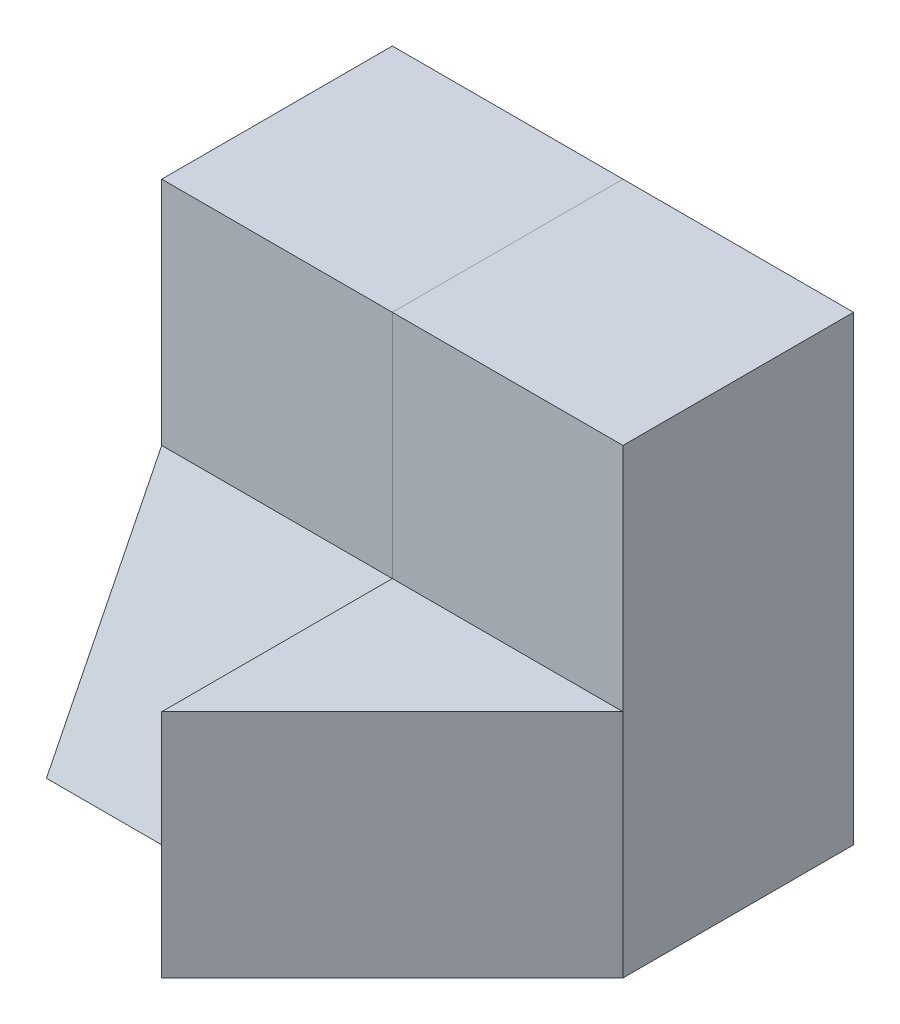
ISO-10303-21;
HEADER;
FILE_DESCRIPTION(('STEP AP214'),'2;1');
FILE_NAME('part.step','',(''),(''),'','','');
FILE_SCHEMA(('AUTOMOTIVE_DESIGN { 1 0 10303 214 1 1 1 1 }'));
ENDSEC;
DATA;
#1=APPLICATION_CONTEXT('core data for automotive mechanical design processes');
#2=APPLICATION_PROTOCOL_DEFINITION('international standard','automotive_design',2000,#1);
#3=PRODUCT_CONTEXT('',#1,'mechanical');
#4=PRODUCT('Part','Part','',(#3));
#5=PRODUCT_RELATED_PRODUCT_CATEGORY('part','',(#4));
#6=PRODUCT_DEFINITION_FORMATION('','',#4);
#7=PRODUCT_DEFINITION_CONTEXT('part definition',#1,'design');
#8=PRODUCT_DEFINITION('design','',#6,#7);
#9=PRODUCT_DEFINITION_SHAPE('','',#8);
#10=(LENGTH_UNIT() NAMED_UNIT(*) SI_UNIT(.MILLI.,.METRE.));
#11=(NAMED_UNIT(*) PLANE_ANGLE_UNIT() SI_UNIT($,.RADIAN.));
#12=(NAMED_UNIT(*) SI_UNIT($,.STERADIAN.) SOLID_ANGLE_UNIT());
#13=UNCERTAINTY_MEASURE_WITH_UNIT(LENGTH_MEASURE(1.E-05),#10,'distance_accuracy_value','');
#14=(GEOMETRIC_REPRESENTATION_CONTEXT(3) GLOBAL_UNCERTAINTY_ASSIGNED_CONTEXT((#13)) GLOBAL_UNIT_ASSIGNED_CONTEXT((#10,
#11,#12)) REPRESENTATION_CONTEXT('',''));
#15=CARTESIAN_POINT('',(0.,0.,0.));
#16=DIRECTION('',(0.,0.,1.));
#17=DIRECTION('',(1.,0.,0.));
#18=AXIS2_PLACEMENT_3D('',#15,#16,#17);
#19=CARTESIAN_POINT('',(0.,40.,40.));
#20=DIRECTION('',(0.,-1.,0.));
#21=DIRECTION('',(0.,0.,-1.));
#22=AXIS2_PLACEMENT_3D('',#19,#20,#21);
#23=PLANE('',#22);
#24=DIRECTION('',(0.,0.,-1.));
#25=VECTOR('',#24,1.);
#26=CARTESIAN_POINT('',(0.,40.,40.));
#27=LINE('',#26,#25);
#28=CARTESIAN_POINT('',(0.,40.,20.001));
#29=VERTEX_POINT('',#28);
#30=CARTESIAN_POINT('',(0.,40.,0.));
#31=VERTEX_POINT('',#30);
#32=EDGE_CURVE('E227',#29,#31,#27,.T.);
#33=ORIENTED_EDGE('',*,*,#32,.F.);
#34=DIRECTION('',(-1.,0.,0.));
#35=VECTOR('',#34,1.);
#36=CARTESIAN_POINT('',(20.0001,40.,20.001));
#37=LINE('',#36,#35);
#38=CARTESIAN_POINT('',(20.,40.,20.001));
#39=VERTEX_POINT('',#38);
#40=EDGE_CURVE('E295',#39,#29,#37,.T.);
#41=ORIENTED_EDGE('',*,*,#40,.F.);
#42=DIRECTION('',(0.,0.,-1.));
#43=VECTOR('',#42,1.);
#44=CARTESIAN_POINT('',(20.,40.,30.));
#45=LINE('',#44,#43);
#46=CARTESIAN_POINT('',(20.,40.,20.));
#47=VERTEX_POINT('',#46);
#48=EDGE_CURVE('E204',#39,#47,#45,.T.);
#49=ORIENTED_EDGE('',*,*,#48,.T.);
#50=DIRECTION('',(0.,0.,1.));
#51=VECTOR('',#50,1.);
#52=CARTESIAN_POINT('',(20.,40.,0.));
#53=LINE('',#52,#51);
#54=CARTESIAN_POINT('',(20.,40.,0.));
#55=VERTEX_POINT('',#54);
#56=EDGE_CURVE('E56',#55,#47,#53,.T.);
#57=ORIENTED_EDGE('',*,*,#56,.F.);
#58=DIRECTION('',(-1.,0.,0.));
#59=VECTOR('',#58,1.);
#60=CARTESIAN_POINT('',(0.,40.,0.));
#61=LINE('',#60,#59);
#62=EDGE_CURVE('E224',#55,#31,#61,.T.);
#63=ORIENTED_EDGE('',*,*,#62,.T.);
#64=EDGE_LOOP('',(#33,#41,#49,#57,#63));
#65=FACE_BOUND('',#64,.T.);
#66=ADVANCED_FACE('F33',(#65),#23,.F.);
#67=CARTESIAN_POINT('',(40.,40.,20.));
#68=DIRECTION('',(0.,0.,-1.));
#69=DIRECTION('',(-1.,0.,0.));
#70=AXIS2_PLACEMENT_3D('',#67,#68,#69);
#71=PLANE('',#70);
#72=DIRECTION('',(-1.,0.,0.));
#73=VECTOR('',#72,1.);
#74=CARTESIAN_POINT('',(40.,20.,20.));
#75=LINE('',#74,#73);
#76=CARTESIAN_POINT('',(40.,20.,20.));
#77=VERTEX_POINT('',#76);
#78=CARTESIAN_POINT('',(20.,20.,20.));
#79=VERTEX_POINT('',#78);
#80=EDGE_CURVE('E212',#77,#79,#75,.T.);
#81=ORIENTED_EDGE('',*,*,#80,.F.);
#82=DIRECTION('',(0.,-1.,0.));
#83=VECTOR('',#82,1.);
#84=CARTESIAN_POINT('',(40.,40.,20.));
#85=LINE('',#84,#83);
#86=CARTESIAN_POINT('',(40.,40.0001,20.));
#87=VERTEX_POINT('',#86);
#88=EDGE_CURVE('E209',#87,#77,#85,.T.);
#89=ORIENTED_EDGE('',*,*,#88,.F.);
#90=DIRECTION('',(1.,0.,0.));
#91=VECTOR('',#90,1.);
#92=CARTESIAN_POINT('',(40.,40.0001,20.));
#93=LINE('',#92,#91);
#94=CARTESIAN_POINT('',(20.,40.0001,20.));
#95=VERTEX_POINT('',#94);
#96=EDGE_CURVE('E283',#95,#87,#93,.T.);
#97=ORIENTED_EDGE('',*,*,#96,.F.);
#98=DIRECTION('',(0.,-1.,0.));
#99=VECTOR('',#98,1.);
#100=CARTESIAN_POINT('',(20.,40.0001,20.));
#101=LINE('',#100,#99);
#102=EDGE_CURVE('E182',#95,#47,#101,.T.);
#103=ORIENTED_EDGE('',*,*,#102,.T.);
#104=DIRECTION('',(0.,1.,0.));
#105=VECTOR('',#104,1.);
#106=CARTESIAN_POINT('',(20.,20.,20.));
#107=LINE('',#106,#105);
#108=CARTESIAN_POINT('',(20.,20.0001499995,20.));
#109=VERTEX_POINT('',#108);
#110=EDGE_CURVE('E200',#109,#47,#107,.T.);
#111=ORIENTED_EDGE('',*,*,#110,.F.);
#112=EDGE_CURVE('E201',#79,#109,#107,.T.);
#113=ORIENTED_EDGE('',*,*,#112,.F.);
#114=EDGE_LOOP('',(#81,#89,#97,#103,#111,#113));
#115=FACE_BOUND('',#114,.T.);
#116=ADVANCED_FACE('F281',(#115),#71,.F.);
#117=CARTESIAN_POINT('',(40.,20.,20.));
#118=DIRECTION('',(0.,-1.,0.));
#119=DIRECTION('',(0.,0.,-1.));
#120=AXIS2_PLACEMENT_3D('',#117,#118,#119);
#121=PLANE('',#120);
#122=DIRECTION('',(0.,0.,1.));
#123=VECTOR('',#122,1.);
#124=CARTESIAN_POINT('',(20.0001,20.,20.));
#125=LINE('',#124,#123);
#126=CARTESIAN_POINT('',(20.0001,20.,20.0014999300028));
#127=VERTEX_POINT('',#126);
#128=CARTESIAN_POINT('',(20.0001,20.0000000050002,39.9999000000002));
#129=VERTEX_POINT('',#128);
#130=EDGE_CURVE('E11',#127,#129,#125,.T.);
#131=ORIENTED_EDGE('',*,*,#130,.T.);
#132=DIRECTION('',(-0.707106781186548,0.,0.707106781186548));
#133=VECTOR('',#132,1.);
#134=CARTESIAN_POINT('',(20.,20.,40.));
#135=LINE('',#134,#133);
#136=EDGE_CURVE('E168',#77,#129,#135,.T.);
#137=ORIENTED_EDGE('',*,*,#136,.F.);
#138=ORIENTED_EDGE('',*,*,#80,.T.);
#139=DIRECTION('',(0.,0.,-1.));
#140=VECTOR('',#139,1.);
#141=CARTESIAN_POINT('',(20.,20.,30.));
#142=LINE('',#141,#140);
#143=CARTESIAN_POINT('',(20.,20.,20.0000749999375));
#144=VERTEX_POINT('',#143);
#145=EDGE_CURVE('E206',#144,#79,#142,.T.);
#146=ORIENTED_EDGE('',*,*,#145,.F.);
#147=CARTESIAN_POINT('',(20.,20.,20.0014999300028));
#148=VERTEX_POINT('',#147);
#149=EDGE_CURVE('E207',#148,#144,#142,.T.);
#150=ORIENTED_EDGE('',*,*,#149,.F.);
#151=DIRECTION('',(1.,0.,0.));
#152=VECTOR('',#151,1.);
#153=CARTESIAN_POINT('',(40.,20.,20.0014999300028));
#154=LINE('',#153,#152);
#155=EDGE_CURVE('E299',#148,#127,#154,.T.);
#156=ORIENTED_EDGE('',*,*,#155,.T.);
#157=EDGE_LOOP('',(#131,#137,#138,#146,#150,#156));
#158=FACE_BOUND('',#157,.T.);
#159=ADVANCED_FACE('F311',(#158),#121,.F.);
#160=CARTESIAN_POINT('',(0.,0.,40.));
#161=DIRECTION('',(1.,0.,0.));
#162=DIRECTION('',(0.,0.,-1.));
#163=AXIS2_PLACEMENT_3D('',#160,#161,#162);
#164=PLANE('',#163);
#165=DIRECTION('',(0.,0.894426743784979,-0.447214489928714));
#166=VECTOR('',#165,1.);
#167=CARTESIAN_POINT('',(0.,39.9999,10.0001));
#168=LINE('',#167,#166);
#169=CARTESIAN_POINT('',(0.,0.000199999500002934,30.));
#170=VERTEX_POINT('',#169);
#171=CARTESIAN_POINT('',(0.,39.9999,10.0001));
#172=VERTEX_POINT('',#171);
#173=EDGE_CURVE('E185',#170,#172,#168,.T.);
#174=ORIENTED_EDGE('',*,*,#173,.F.);
#175=DIRECTION('',(0.,-0.894452233262744,0.447163507468231));
#176=VECTOR('',#175,1.);
#177=CARTESIAN_POINT('',(0.,0.000199999500002934,30.));
#178=LINE('',#177,#176);
#179=CARTESIAN_POINT('',(0.,20.001,20.001));
#180=VERTEX_POINT('',#179);
#181=EDGE_CURVE('E165',#180,#170,#178,.T.);
#182=ORIENTED_EDGE('',*,*,#181,.F.);
#183=DIRECTION('',(0.,-1.,0.));
#184=VECTOR('',#183,1.);
#185=CARTESIAN_POINT('',(0.,40.,20.001));
#186=LINE('',#185,#184);
#187=EDGE_CURVE('E259',#29,#180,#186,.T.);
#188=ORIENTED_EDGE('',*,*,#187,.F.);
#189=ORIENTED_EDGE('',*,*,#32,.T.);
#190=DIRECTION('',(0.,-1.,0.));
#191=VECTOR('',#190,1.);
#192=CARTESIAN_POINT('',(0.,0.,0.));
#193=LINE('',#192,#191);
#194=CARTESIAN_POINT('',(0.,0.,0.));
#195=VERTEX_POINT('',#194);
#196=EDGE_CURVE('E216',#31,#195,#193,.T.);
#197=ORIENTED_EDGE('',*,*,#196,.T.);
#198=DIRECTION('',(0.,0.,-1.));
#199=VECTOR('',#198,1.);
#200=CARTESIAN_POINT('',(0.,0.,40.));
#201=LINE('',#200,#199);
#202=CARTESIAN_POINT('',(0.,0.,0.0001));
#203=VERTEX_POINT('',#202);
#204=EDGE_CURVE('E244',#203,#195,#201,.T.);
#205=ORIENTED_EDGE('',*,*,#204,.F.);
#206=DIRECTION('',(0.,-0.970142357476814,-0.242536195709693));
#207=VECTOR('',#206,1.);
#208=CARTESIAN_POINT('',(0.,39.9999,10.0001));
#209=LINE('',#208,#207);
#210=EDGE_CURVE('E180',#172,#203,#209,.T.);
#211=ORIENTED_EDGE('',*,*,#210,.F.);
#212=EDGE_LOOP('',(#174,#182,#188,#189,#197,#205,#211));
#213=FACE_BOUND('',#212,.T.);
#214=ADVANCED_FACE('F35',(#213),#164,.F.);
#215=CARTESIAN_POINT('',(0.,0.,40.));
#216=DIRECTION('',(0.,1.,0.));
#217=DIRECTION('',(0.,0.,1.));
#218=AXIS2_PLACEMENT_3D('',#215,#216,#217);
#219=PLANE('',#218);
#220=DIRECTION('',(0.,0.,-1.));
#221=VECTOR('',#220,1.);
#222=CARTESIAN_POINT('',(20.,0.,40.));
#223=LINE('',#222,#221);
#224=CARTESIAN_POINT('',(20.,0.,40.));
#225=VERTEX_POINT('',#224);
#226=CARTESIAN_POINT('',(20.,0.,0.0001));
#227=VERTEX_POINT('',#226);
#228=EDGE_CURVE('E159',#225,#227,#223,.T.);
#229=ORIENTED_EDGE('',*,*,#228,.T.);
#230=DIRECTION('',(-1.,0.,0.));
#231=VECTOR('',#230,1.);
#232=CARTESIAN_POINT('',(20.,0.,0.0001));
#233=LINE('',#232,#231);
#234=EDGE_CURVE('E169',#227,#203,#233,.T.);
#235=ORIENTED_EDGE('',*,*,#234,.T.);
#236=ORIENTED_EDGE('',*,*,#204,.T.);
#237=DIRECTION('',(1.,0.,0.));
#238=VECTOR('',#237,1.);
#239=CARTESIAN_POINT('',(0.,0.,0.));
#240=LINE('',#239,#238);
#241=CARTESIAN_POINT('',(40.,0.,0.));
#242=VERTEX_POINT('',#241);
#243=EDGE_CURVE('E219',#195,#242,#240,.T.);
#244=ORIENTED_EDGE('',*,*,#243,.T.);
#245=DIRECTION('',(0.,0.,-1.));
#246=VECTOR('',#245,1.);
#247=CARTESIAN_POINT('',(40.,0.,40.));
#248=LINE('',#247,#246);
#249=CARTESIAN_POINT('',(40.,0.,20.));
#250=VERTEX_POINT('',#249);
#251=EDGE_CURVE('E247',#250,#242,#248,.T.);
#252=ORIENTED_EDGE('',*,*,#251,.F.);
#253=DIRECTION('',(-0.707106781186548,0.,0.707106781186548));
#254=VECTOR('',#253,1.);
#255=CARTESIAN_POINT('',(10.,0.,50.));
#256=LINE('',#255,#254);
#257=CARTESIAN_POINT('',(20.0001,1.99999489396855E-09,39.9999));
#258=VERTEX_POINT('',#257);
#259=EDGE_CURVE('E197',#250,#258,#256,.T.);
#260=ORIENTED_EDGE('',*,*,#259,.T.);
#261=DIRECTION('',(-0.707106781115837,-1.41421002671852E-05,0.707106781115837));
#262=VECTOR('',#261,1.);
#263=CARTESIAN_POINT('',(19.999930000175,-1.39999383613754E-09,40.000069999825));
#264=LINE('',#263,#262);
#265=EDGE_CURVE('E267',#258,#225,#264,.T.);
#266=ORIENTED_EDGE('',*,*,#265,.T.);
#267=EDGE_LOOP('',(#229,#235,#236,#244,#252,#260,#266));
#268=FACE_BOUND('',#267,.T.);
#269=ADVANCED_FACE('F266',(#268),#219,.F.);
#270=CARTESIAN_POINT('',(40.,0.,40.));
#271=DIRECTION('',(-1.,0.,0.));
#272=DIRECTION('',(0.,0.,1.));
#273=AXIS2_PLACEMENT_3D('',#270,#271,#272);
#274=PLANE('',#273);
#275=ORIENTED_EDGE('',*,*,#88,.T.);
#276=DIRECTION('',(0.,1.,0.));
#277=VECTOR('',#276,1.);
#278=CARTESIAN_POINT('',(40.,-7.00000000000001,20.));
#279=LINE('',#278,#277);
#280=EDGE_CURVE('E195',#250,#77,#279,.T.);
#281=ORIENTED_EDGE('',*,*,#280,.F.);
#282=ORIENTED_EDGE('',*,*,#251,.T.);
#283=DIRECTION('',(0.,1.,0.));
#284=VECTOR('',#283,1.);
#285=CARTESIAN_POINT('',(40.,0.,0.));
#286=LINE('',#285,#284);
#287=CARTESIAN_POINT('',(40.,40.0001,0.));
#288=VERTEX_POINT('',#287);
#289=EDGE_CURVE('E222',#242,#288,#286,.T.);
#290=ORIENTED_EDGE('',*,*,#289,.T.);
#291=DIRECTION('',(0.,0.,-1.));
#292=VECTOR('',#291,1.);
#293=CARTESIAN_POINT('',(40.,40.0001,0.));
#294=LINE('',#293,#292);
#295=EDGE_CURVE('E234',#87,#288,#294,.T.);
#296=ORIENTED_EDGE('',*,*,#295,.F.);
#297=EDGE_LOOP('',(#275,#281,#282,#290,#296));
#298=FACE_BOUND('',#297,.T.);
#299=ADVANCED_FACE('F274',(#298),#274,.F.);
#300=CARTESIAN_POINT('',(0.,0.,0.));
#301=DIRECTION('',(0.,0.,-1.));
#302=DIRECTION('',(-1.,0.,0.));
#303=AXIS2_PLACEMENT_3D('',#300,#301,#302);
#304=PLANE('',#303);
#305=ORIENTED_EDGE('',*,*,#196,.F.);
#306=ORIENTED_EDGE('',*,*,#62,.F.);
#307=DIRECTION('',(0.,-1.,0.));
#308=VECTOR('',#307,1.);
#309=CARTESIAN_POINT('',(20.,40.0001,0.));
#310=LINE('',#309,#308);
#311=CARTESIAN_POINT('',(20.,40.0001,0.));
#312=VERTEX_POINT('',#311);
#313=EDGE_CURVE('E187',#312,#55,#310,.T.);
#314=ORIENTED_EDGE('',*,*,#313,.F.);
#315=DIRECTION('',(-1.,0.,0.));
#316=VECTOR('',#315,1.);
#317=CARTESIAN_POINT('',(40.,40.0001,0.));
#318=LINE('',#317,#316);
#319=EDGE_CURVE('E290',#288,#312,#318,.T.);
#320=ORIENTED_EDGE('',*,*,#319,.F.);
#321=ORIENTED_EDGE('',*,*,#289,.F.);
#322=ORIENTED_EDGE('',*,*,#243,.F.);
#323=EDGE_LOOP('',(#305,#306,#314,#320,#321,#322));
#324=FACE_BOUND('',#323,.T.);
#325=ADVANCED_FACE('F263',(#324),#304,.T.);
#326=CARTESIAN_POINT('',(20.,0.,40.));
#327=DIRECTION('',(1.,0.,0.));
#328=DIRECTION('',(0.,0.,-1.));
#329=AXIS2_PLACEMENT_3D('',#326,#327,#328);
#330=PLANE('',#329);
#331=ORIENTED_EDGE('',*,*,#228,.F.);
#332=DIRECTION('',(0.,-1.99999499962934E-05,0.999999999800001));
#333=VECTOR('',#332,1.);
#334=CARTESIAN_POINT('',(20.,0.000199999500002934,30.));
#335=LINE('',#334,#333);
#336=CARTESIAN_POINT('',(20.,0.000199999500002934,30.));
#337=VERTEX_POINT('',#336);
#338=EDGE_CURVE('E142',#337,#225,#335,.T.);
#339=ORIENTED_EDGE('',*,*,#338,.F.);
#340=DIRECTION('',(0.,0.894426743784979,-0.447214489928714));
#341=VECTOR('',#340,1.);
#342=CARTESIAN_POINT('',(20.,39.9999,10.0001));
#343=LINE('',#342,#341);
#344=EDGE_CURVE('E156',#337,#144,#343,.T.);
#345=ORIENTED_EDGE('',*,*,#344,.T.);
#346=ORIENTED_EDGE('',*,*,#145,.T.);
#347=ORIENTED_EDGE('',*,*,#112,.T.);
#348=CARTESIAN_POINT('',(20.,39.9999,10.0001));
#349=VERTEX_POINT('',#348);
#350=EDGE_CURVE('E176',#109,#349,#343,.T.);
#351=ORIENTED_EDGE('',*,*,#350,.T.);
#352=DIRECTION('',(0.,-0.970142357476814,-0.242536195709693));
#353=VECTOR('',#352,1.);
#354=CARTESIAN_POINT('',(20.,39.9999,10.0001));
#355=LINE('',#354,#353);
#356=EDGE_CURVE('E175',#349,#227,#355,.T.);
#357=ORIENTED_EDGE('',*,*,#356,.T.);
#358=EDGE_LOOP('',(#331,#339,#345,#346,#347,#351,#357));
#359=FACE_BOUND('',#358,.T.);
#360=ADVANCED_FACE('F154',(#359),#330,.F.);
#361=CARTESIAN_POINT('',(20.,20.,30.));
#362=DIRECTION('',(-1.,0.,0.));
#363=DIRECTION('',(0.,0.,1.));
#364=AXIS2_PLACEMENT_3D('',#361,#362,#363);
#365=PLANE('',#364);
#366=DIRECTION('',(0.,-1.,0.));
#367=VECTOR('',#366,1.);
#368=CARTESIAN_POINT('',(20.,20.,20.001));
#369=LINE('',#368,#367);
#370=CARTESIAN_POINT('',(20.,20.001,20.001));
#371=VERTEX_POINT('',#370);
#372=EDGE_CURVE('E41',#39,#371,#369,.T.);
#373=ORIENTED_EDGE('',*,*,#372,.T.);
#374=DIRECTION('',(0.,-0.894452233262744,0.447163507468231));
#375=VECTOR('',#374,1.);
#376=CARTESIAN_POINT('',(20.,16.0009359427147,22.0007520353084));
#377=LINE('',#376,#375);
#378=EDGE_CURVE('E48',#371,#148,#377,.T.);
#379=ORIENTED_EDGE('',*,*,#378,.T.);
#380=ORIENTED_EDGE('',*,*,#149,.T.);
#381=DIRECTION('',(0.,0.894426743784979,-0.447214489928714));
#382=VECTOR('',#381,1.);
#383=CARTESIAN_POINT('',(20.,16.000024000016,22.000067999912));
#384=LINE('',#383,#382);
#385=EDGE_CURVE('E174',#144,#109,#384,.T.);
#386=ORIENTED_EDGE('',*,*,#385,.T.);
#387=ORIENTED_EDGE('',*,*,#110,.T.);
#388=ORIENTED_EDGE('',*,*,#48,.F.);
#389=EDGE_LOOP('',(#373,#379,#380,#386,#387,#388));
#390=FACE_BOUND('',#389,.T.);
#391=ADVANCED_FACE('F312',(#390),#365,.F.);
#392=CARTESIAN_POINT('',(20.,-7.00000000000001,40.));
#393=DIRECTION('',(-0.707106781186547,0.,-0.707106781186547));
#394=DIRECTION('',(-0.707106781186548,0.,0.707106781186548));
#395=AXIS2_PLACEMENT_3D('',#392,#393,#394);
#396=PLANE('',#395);
#397=ORIENTED_EDGE('',*,*,#136,.T.);
#398=DIRECTION('',(0.,-1.,0.));
#399=VECTOR('',#398,1.);
#400=CARTESIAN_POINT('',(20.0001,-7.00000000000001,39.9999));
#401=LINE('',#400,#399);
#402=EDGE_CURVE('E273',#129,#258,#401,.T.);
#403=ORIENTED_EDGE('',*,*,#402,.T.);
#404=ORIENTED_EDGE('',*,*,#259,.F.);
#405=ORIENTED_EDGE('',*,*,#280,.T.);
#406=EDGE_LOOP('',(#397,#403,#404,#405));
#407=FACE_BOUND('',#406,.T.);
#408=ADVANCED_FACE('F270',(#407),#396,.F.);
#409=CARTESIAN_POINT('',(20.,39.9999,10.0001));
#410=DIRECTION('',(0.,0.447214489928714,0.894426743784979));
#411=DIRECTION('',(0.,-0.894426743784979,0.447214489928714));
#412=AXIS2_PLACEMENT_3D('',#409,#410,#411);
#413=PLANE('',#412);
#414=ORIENTED_EDGE('',*,*,#173,.T.);
#415=DIRECTION('',(-1.,0.,0.));
#416=VECTOR('',#415,1.);
#417=CARTESIAN_POINT('',(20.,39.9999,10.0001));
#418=LINE('',#417,#416);
#419=EDGE_CURVE('E178',#349,#172,#418,.T.);
#420=ORIENTED_EDGE('',*,*,#419,.F.);
#421=ORIENTED_EDGE('',*,*,#350,.F.);
#422=ORIENTED_EDGE('',*,*,#385,.F.);
#423=ORIENTED_EDGE('',*,*,#344,.F.);
#424=DIRECTION('',(1.,0.,0.));
#425=VECTOR('',#424,1.);
#426=CARTESIAN_POINT('',(0.,0.000199999500006753,30.));
#427=LINE('',#426,#425);
#428=EDGE_CURVE('E162',#170,#337,#427,.T.);
#429=ORIENTED_EDGE('',*,*,#428,.F.);
#430=EDGE_LOOP('',(#414,#420,#421,#422,#423,#429));
#431=FACE_BOUND('',#430,.T.);
#432=ADVANCED_FACE('F172',(#431),#413,.F.);
#433=CARTESIAN_POINT('',(20.,39.9999,10.0001));
#434=DIRECTION('',(0.,0.242536195709693,-0.970142357476814));
#435=DIRECTION('',(0.,0.970142357476814,0.242536195709693));
#436=AXIS2_PLACEMENT_3D('',#433,#434,#435);
#437=PLANE('',#436);
#438=ORIENTED_EDGE('',*,*,#210,.T.);
#439=ORIENTED_EDGE('',*,*,#234,.F.);
#440=ORIENTED_EDGE('',*,*,#356,.F.);
#441=ORIENTED_EDGE('',*,*,#419,.T.);
#442=EDGE_LOOP('',(#438,#439,#440,#441));
#443=FACE_BOUND('',#442,.T.);
#444=ADVANCED_FACE('F354',(#443),#437,.F.);
#445=CARTESIAN_POINT('',(20.,40.0001,0.));
#446=DIRECTION('',(1.,0.,0.));
#447=DIRECTION('',(0.,0.,-1.));
#448=AXIS2_PLACEMENT_3D('',#445,#446,#447);
#449=PLANE('',#448);
#450=ORIENTED_EDGE('',*,*,#56,.T.);
#451=ORIENTED_EDGE('',*,*,#102,.F.);
#452=DIRECTION('',(0.,0.,1.));
#453=VECTOR('',#452,1.);
#454=CARTESIAN_POINT('',(20.,40.0001,0.));
#455=LINE('',#454,#453);
#456=EDGE_CURVE('E288',#312,#95,#455,.T.);
#457=ORIENTED_EDGE('',*,*,#456,.F.);
#458=ORIENTED_EDGE('',*,*,#313,.T.);
#459=EDGE_LOOP('',(#450,#451,#457,#458));
#460=FACE_BOUND('',#459,.T.);
#461=ADVANCED_FACE('F373',(#460),#449,.F.);
#462=CARTESIAN_POINT('',(0.,40.0001,0.));
#463=DIRECTION('',(0.,-1.,0.));
#464=DIRECTION('',(0.,0.,-1.));
#465=AXIS2_PLACEMENT_3D('',#462,#463,#464);
#466=PLANE('',#465);
#467=ORIENTED_EDGE('',*,*,#295,.T.);
#468=ORIENTED_EDGE('',*,*,#319,.T.);
#469=ORIENTED_EDGE('',*,*,#456,.T.);
#470=ORIENTED_EDGE('',*,*,#96,.T.);
#471=EDGE_LOOP('',(#467,#468,#469,#470));
#472=FACE_BOUND('',#471,.T.);
#473=ADVANCED_FACE('F286',(#472),#466,.F.);
#474=CARTESIAN_POINT('',(20.0001,40.,20.001));
#475=DIRECTION('',(0.,0.,-1.));
#476=DIRECTION('',(-1.,0.,0.));
#477=AXIS2_PLACEMENT_3D('',#474,#475,#476);
#478=PLANE('',#477);
#479=ORIENTED_EDGE('',*,*,#40,.T.);
#480=ORIENTED_EDGE('',*,*,#187,.T.);
#481=DIRECTION('',(-1.,0.,0.));
#482=VECTOR('',#481,1.);
#483=CARTESIAN_POINT('',(20.0001,20.001,20.001));
#484=LINE('',#483,#482);
#485=EDGE_CURVE('E235',#371,#180,#484,.T.);
#486=ORIENTED_EDGE('',*,*,#485,.F.);
#487=ORIENTED_EDGE('',*,*,#372,.F.);
#488=EDGE_LOOP('',(#479,#480,#486,#487));
#489=FACE_BOUND('',#488,.T.);
#490=ADVANCED_FACE('F385',(#489),#478,.F.);
#491=CARTESIAN_POINT('',(20.0001,0.,0.));
#492=DIRECTION('',(1.,0.,0.));
#493=DIRECTION('',(0.,0.,-1.));
#494=AXIS2_PLACEMENT_3D('',#491,#492,#493);
#495=PLANE('',#494);
#496=DIRECTION('',(0.,-0.894452233262744,0.447163507468231));
#497=VECTOR('',#496,1.);
#498=CARTESIAN_POINT('',(20.0001,0.000199999500002934,30.));
#499=LINE('',#498,#497);
#500=CARTESIAN_POINT('',(20.0001,0.000199999500002934,30.));
#501=VERTEX_POINT('',#500);
#502=EDGE_CURVE('E149',#127,#501,#499,.T.);
#503=ORIENTED_EDGE('',*,*,#502,.T.);
#504=DIRECTION('',(0.,-1.99999499962934E-05,0.999999999800001));
#505=VECTOR('',#504,1.);
#506=CARTESIAN_POINT('',(20.0001,0.000199999500002934,30.));
#507=LINE('',#506,#505);
#508=EDGE_CURVE('E145',#501,#258,#507,.T.);
#509=ORIENTED_EDGE('',*,*,#508,.T.);
#510=ORIENTED_EDGE('',*,*,#402,.F.);
#511=ORIENTED_EDGE('',*,*,#130,.F.);
#512=EDGE_LOOP('',(#503,#509,#510,#511));
#513=FACE_BOUND('',#512,.T.);
#514=ADVANCED_FACE('F308',(#513),#495,.F.);
#515=CARTESIAN_POINT('',(20.0001,0.000199999500002934,30.));
#516=DIRECTION('',(0.,-0.447163507468231,-0.894452233262743));
#517=DIRECTION('',(0.,0.894452233262744,-0.447163507468231));
#518=AXIS2_PLACEMENT_3D('',#515,#516,#517);
#519=PLANE('',#518);
#520=ORIENTED_EDGE('',*,*,#155,.F.);
#521=ORIENTED_EDGE('',*,*,#378,.F.);
#522=ORIENTED_EDGE('',*,*,#485,.T.);
#523=ORIENTED_EDGE('',*,*,#181,.T.);
#524=ORIENTED_EDGE('',*,*,#428,.T.);
#525=DIRECTION('',(-1.,0.,0.));
#526=VECTOR('',#525,1.);
#527=CARTESIAN_POINT('',(20.0001,0.000199999500002934,30.));
#528=LINE('',#527,#526);
#529=EDGE_CURVE('E139',#501,#337,#528,.T.);
#530=ORIENTED_EDGE('',*,*,#529,.F.);
#531=ORIENTED_EDGE('',*,*,#502,.F.);
#532=EDGE_LOOP('',(#520,#521,#522,#523,#524,#530,#531));
#533=FACE_BOUND('',#532,.T.);
#534=ADVANCED_FACE('F163',(#533),#519,.F.);
#535=CARTESIAN_POINT('',(20.0001,0.000199999500002934,30.));
#536=DIRECTION('',(0.,-0.999999999800001,-1.99999499962934E-05));
#537=DIRECTION('',(0.,1.99999499962934E-05,-0.999999999800001));
#538=AXIS2_PLACEMENT_3D('',#535,#536,#537);
#539=PLANE('',#538);
#540=ORIENTED_EDGE('',*,*,#508,.F.);
#541=ORIENTED_EDGE('',*,*,#529,.T.);
#542=ORIENTED_EDGE('',*,*,#338,.T.);
#543=ORIENTED_EDGE('',*,*,#265,.F.);
#544=EDGE_LOOP('',(#540,#541,#542,#543));
#545=FACE_BOUND('',#544,.T.);
#546=ADVANCED_FACE('F141',(#545),#539,.F.);
#547=CLOSED_SHELL('',(#66,#116,#159,#214,#269,#299,#325,#360,#391,#408,#432,#444,#461,#473,#490,
#514,#534,#546));
#548=MANIFOLD_SOLID_BREP('B2',#547);
#549=ADVANCED_BREP_SHAPE_REPRESENTATION('',(#18,#548),#14);
#550=SHAPE_DEFINITION_REPRESENTATION(#9,#549);
ENDSEC;
END-ISO-10303-21;
